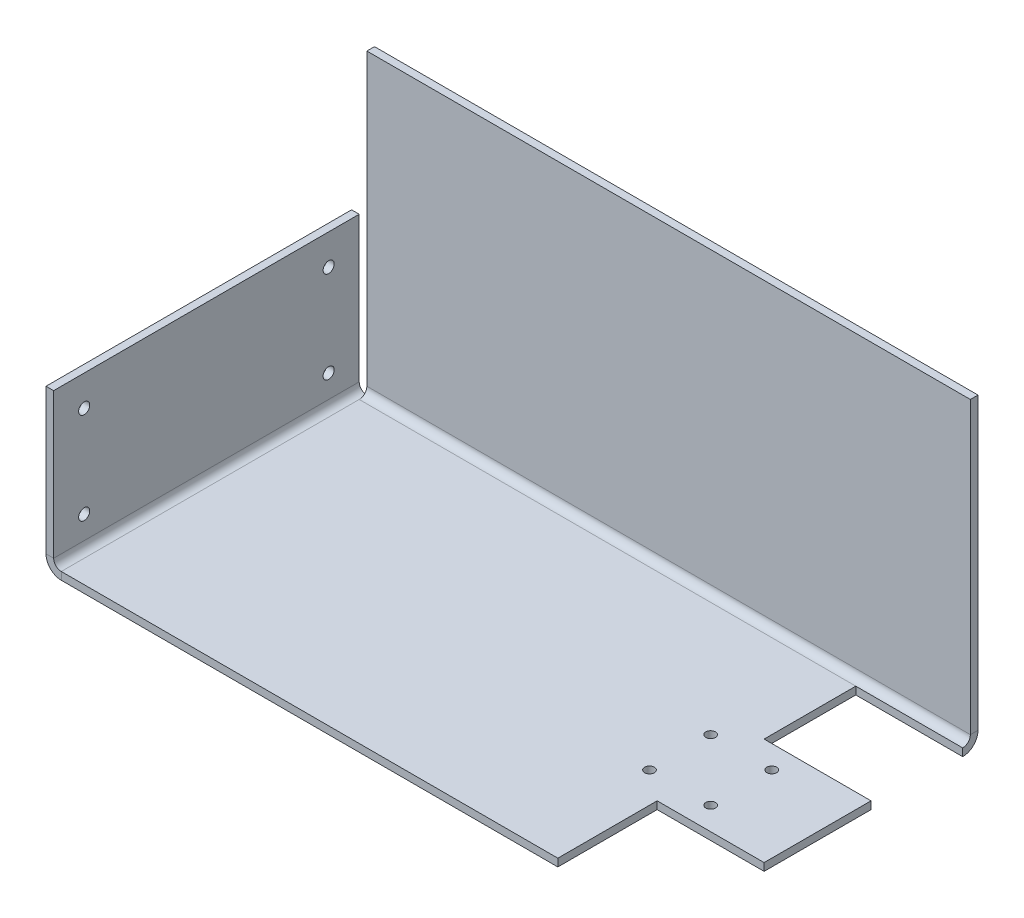
ISO-10303-21;
HEADER;
FILE_DESCRIPTION(('STEP AP214'),'2;1');
FILE_NAME('part.step','',(''),(''),'','','');
FILE_SCHEMA(('AUTOMOTIVE_DESIGN { 1 0 10303 214 1 1 1 1 }'));
ENDSEC;
DATA;
#1=APPLICATION_CONTEXT('core data for automotive mechanical design processes');
#2=APPLICATION_PROTOCOL_DEFINITION('international standard','automotive_design',2000,#1);
#3=PRODUCT_CONTEXT('',#1,'mechanical');
#4=PRODUCT('Part','Part','',(#3));
#5=PRODUCT_RELATED_PRODUCT_CATEGORY('part','',(#4));
#6=PRODUCT_DEFINITION_FORMATION('','',#4);
#7=PRODUCT_DEFINITION_CONTEXT('part definition',#1,'design');
#8=PRODUCT_DEFINITION('design','',#6,#7);
#9=PRODUCT_DEFINITION_SHAPE('','',#8);
#10=(LENGTH_UNIT() NAMED_UNIT(*) SI_UNIT(.MILLI.,.METRE.));
#11=(NAMED_UNIT(*) PLANE_ANGLE_UNIT() SI_UNIT($,.RADIAN.));
#12=(NAMED_UNIT(*) SI_UNIT($,.STERADIAN.) SOLID_ANGLE_UNIT());
#13=UNCERTAINTY_MEASURE_WITH_UNIT(LENGTH_MEASURE(1.E-05),#10,'distance_accuracy_value','');
#14=(GEOMETRIC_REPRESENTATION_CONTEXT(3) GLOBAL_UNCERTAINTY_ASSIGNED_CONTEXT((#13)) GLOBAL_UNIT_ASSIGNED_CONTEXT((#10,
#11,#12)) REPRESENTATION_CONTEXT('',''));
#15=CARTESIAN_POINT('',(0.,0.,0.));
#16=DIRECTION('',(0.,0.,1.));
#17=DIRECTION('',(1.,0.,0.));
#18=AXIS2_PLACEMENT_3D('',#15,#16,#17);
#19=CARTESIAN_POINT('',(0.,-3.175,127.));
#20=DIRECTION('',(0.,1.,0.));
#21=DIRECTION('',(0.,0.,1.));
#22=AXIS2_PLACEMENT_3D('',#19,#20,#21);
#23=PLANE('',#22);
#24=CARTESIAN_POINT('',(222.25,-3.175,50.8));
#25=DIRECTION('',(0.,-1.,0.));
#26=DIRECTION('',(0.,0.,-1.));
#27=AXIS2_PLACEMENT_3D('',#24,#25,#26);
#28=CIRCLE('',#27,2.0193);
#29=CARTESIAN_POINT('',(222.25,-3.175,48.7807));
#30=VERTEX_POINT('',#29);
#31=EDGE_CURVE('E425',#30,#30,#28,.T.);
#32=ORIENTED_EDGE('',*,*,#31,.F.);
#33=EDGE_LOOP('',(#32));
#34=FACE_BOUND('',#33,.T.);
#35=CARTESIAN_POINT('',(196.85,-3.175,50.8));
#36=DIRECTION('',(0.,-1.,0.));
#37=DIRECTION('',(0.,0.,-1.));
#38=AXIS2_PLACEMENT_3D('',#35,#36,#37);
#39=CIRCLE('',#38,2.0193);
#40=CARTESIAN_POINT('',(196.85,-3.175,48.7807));
#41=VERTEX_POINT('',#40);
#42=EDGE_CURVE('E419',#41,#41,#39,.T.);
#43=ORIENTED_EDGE('',*,*,#42,.F.);
#44=EDGE_LOOP('',(#43));
#45=FACE_BOUND('',#44,.T.);
#46=CARTESIAN_POINT('',(196.85,-3.175,76.2));
#47=DIRECTION('',(0.,-1.,0.));
#48=DIRECTION('',(0.,0.,-1.));
#49=AXIS2_PLACEMENT_3D('',#46,#47,#48);
#50=CIRCLE('',#49,2.0193);
#51=CARTESIAN_POINT('',(196.85,-3.175,74.1807));
#52=VERTEX_POINT('',#51);
#53=EDGE_CURVE('E406',#52,#52,#50,.T.);
#54=ORIENTED_EDGE('',*,*,#53,.F.);
#55=EDGE_LOOP('',(#54));
#56=FACE_BOUND('',#55,.T.);
#57=CARTESIAN_POINT('',(222.25,-3.175,76.2));
#58=DIRECTION('',(0.,-1.,0.));
#59=DIRECTION('',(0.,0.,-1.));
#60=AXIS2_PLACEMENT_3D('',#57,#58,#59);
#61=CIRCLE('',#60,2.0193);
#62=CARTESIAN_POINT('',(222.25,-3.175,74.1807));
#63=VERTEX_POINT('',#62);
#64=EDGE_CURVE('E402',#63,#63,#61,.T.);
#65=ORIENTED_EDGE('',*,*,#64,.F.);
#66=EDGE_LOOP('',(#65));
#67=FACE_BOUND('',#66,.T.);
#68=DIRECTION('',(0.,0.,1.));
#69=VECTOR('',#68,1.);
#70=CARTESIAN_POINT('',(209.55,-3.175,0.));
#71=LINE('',#70,#69);
#72=CARTESIAN_POINT('',(209.55,-3.175,85.725));
#73=VERTEX_POINT('',#72);
#74=CARTESIAN_POINT('',(209.55,-3.175,127.));
#75=VERTEX_POINT('',#74);
#76=EDGE_CURVE('E186',#73,#75,#71,.T.);
#77=ORIENTED_EDGE('',*,*,#76,.T.);
#78=DIRECTION('',(1.,0.,0.));
#79=VECTOR('',#78,1.);
#80=CARTESIAN_POINT('',(0.,-3.175,127.));
#81=LINE('',#80,#79);
#82=CARTESIAN_POINT('',(3.175,-3.175,127.));
#83=VERTEX_POINT('',#82);
#84=EDGE_CURVE('E316',#83,#75,#81,.T.);
#85=ORIENTED_EDGE('',*,*,#84,.F.);
#86=DIRECTION('',(0.,0.,-1.));
#87=VECTOR('',#86,1.);
#88=CARTESIAN_POINT('',(3.175,-3.175,127.));
#89=LINE('',#88,#87);
#90=CARTESIAN_POINT('',(3.175,-3.175,3.17499999999998));
#91=VERTEX_POINT('',#90);
#92=EDGE_CURVE('E344',#83,#91,#89,.T.);
#93=ORIENTED_EDGE('',*,*,#92,.T.);
#94=DIRECTION('',(-1.,0.,0.));
#95=VECTOR('',#94,1.);
#96=CARTESIAN_POINT('',(3.17500000000004,-3.17500000000004,3.175));
#97=LINE('',#96,#95);
#98=CARTESIAN_POINT('',(209.55,-3.175,3.17500000000001));
#99=VERTEX_POINT('',#98);
#100=EDGE_CURVE('E279',#91,#99,#97,.F.);
#101=ORIENTED_EDGE('',*,*,#100,.T.);
#102=DIRECTION('',(0.,0.,-1.));
#103=VECTOR('',#102,1.);
#104=CARTESIAN_POINT('',(209.55,-3.175,0.));
#105=LINE('',#104,#103);
#106=CARTESIAN_POINT('',(209.55,-3.175,41.275));
#107=VERTEX_POINT('',#106);
#108=EDGE_CURVE('E210',#107,#99,#105,.T.);
#109=ORIENTED_EDGE('',*,*,#108,.F.);
#110=DIRECTION('',(-1.,0.,0.));
#111=VECTOR('',#110,1.);
#112=CARTESIAN_POINT('',(0.,-3.175,41.275));
#113=LINE('',#112,#111);
#114=CARTESIAN_POINT('',(254.,-3.175,41.275));
#115=VERTEX_POINT('',#114);
#116=EDGE_CURVE('E206',#115,#107,#113,.T.);
#117=ORIENTED_EDGE('',*,*,#116,.F.);
#118=DIRECTION('',(0.,0.,-1.));
#119=VECTOR('',#118,1.);
#120=CARTESIAN_POINT('',(254.,-3.175,127.));
#121=LINE('',#120,#119);
#122=CARTESIAN_POINT('',(254.,-3.175,85.725));
#123=VERTEX_POINT('',#122);
#124=EDGE_CURVE('E198',#123,#115,#121,.T.);
#125=ORIENTED_EDGE('',*,*,#124,.F.);
#126=DIRECTION('',(-1.,0.,0.));
#127=VECTOR('',#126,1.);
#128=CARTESIAN_POINT('',(0.,-3.175,85.725));
#129=LINE('',#128,#127);
#130=EDGE_CURVE('E65',#123,#73,#129,.T.);
#131=ORIENTED_EDGE('',*,*,#130,.T.);
#132=EDGE_LOOP('',(#77,#85,#93,#101,#109,#117,#125,#131));
#133=FACE_BOUND('',#132,.T.);
#134=ADVANCED_FACE('F47',(#34,#45,#56,#67,#133),#23,.F.);
#135=CARTESIAN_POINT('',(0.,0.,127.));
#136=DIRECTION('',(0.,1.,0.));
#137=DIRECTION('',(0.,0.,1.));
#138=AXIS2_PLACEMENT_3D('',#135,#136,#137);
#139=PLANE('',#138);
#140=CARTESIAN_POINT('',(222.25,0.,50.8));
#141=DIRECTION('',(0.,1.,0.));
#142=DIRECTION('',(0.,0.,1.));
#143=AXIS2_PLACEMENT_3D('',#140,#141,#142);
#144=CIRCLE('',#143,2.01929999999999);
#145=CARTESIAN_POINT('',(222.25,0.,52.8193));
#146=VERTEX_POINT('',#145);
#147=EDGE_CURVE('E51',#146,#146,#144,.T.);
#148=ORIENTED_EDGE('',*,*,#147,.F.);
#149=EDGE_LOOP('',(#148));
#150=FACE_BOUND('',#149,.T.);
#151=CARTESIAN_POINT('',(196.85,0.,50.8));
#152=DIRECTION('',(0.,1.,0.));
#153=DIRECTION('',(0.,0.,1.));
#154=AXIS2_PLACEMENT_3D('',#151,#152,#153);
#155=CIRCLE('',#154,2.01929999999999);
#156=CARTESIAN_POINT('',(196.85,0.,52.8193));
#157=VERTEX_POINT('',#156);
#158=EDGE_CURVE('E413',#157,#157,#155,.T.);
#159=ORIENTED_EDGE('',*,*,#158,.F.);
#160=EDGE_LOOP('',(#159));
#161=FACE_BOUND('',#160,.T.);
#162=CARTESIAN_POINT('',(196.85,0.,76.2));
#163=DIRECTION('',(0.,1.,0.));
#164=DIRECTION('',(0.,0.,1.));
#165=AXIS2_PLACEMENT_3D('',#162,#163,#164);
#166=CIRCLE('',#165,2.01929999999999);
#167=CARTESIAN_POINT('',(196.85,0.,78.2193));
#168=VERTEX_POINT('',#167);
#169=EDGE_CURVE('E403',#168,#168,#166,.T.);
#170=ORIENTED_EDGE('',*,*,#169,.F.);
#171=EDGE_LOOP('',(#170));
#172=FACE_BOUND('',#171,.T.);
#173=CARTESIAN_POINT('',(222.25,0.,76.2));
#174=DIRECTION('',(0.,1.,0.));
#175=DIRECTION('',(0.,0.,1.));
#176=AXIS2_PLACEMENT_3D('',#173,#174,#175);
#177=CIRCLE('',#176,2.01929999999999);
#178=CARTESIAN_POINT('',(222.25,0.,78.2193));
#179=VERTEX_POINT('',#178);
#180=EDGE_CURVE('E211',#179,#179,#177,.T.);
#181=ORIENTED_EDGE('',*,*,#180,.F.);
#182=EDGE_LOOP('',(#181));
#183=FACE_BOUND('',#182,.T.);
#184=DIRECTION('',(1.,0.,0.));
#185=VECTOR('',#184,1.);
#186=CARTESIAN_POINT('',(0.,0.,127.));
#187=LINE('',#186,#185);
#188=CARTESIAN_POINT('',(3.175,0.,127.));
#189=VERTEX_POINT('',#188);
#190=CARTESIAN_POINT('',(209.55,0.,127.));
#191=VERTEX_POINT('',#190);
#192=EDGE_CURVE('E319',#189,#191,#187,.T.);
#193=ORIENTED_EDGE('',*,*,#192,.T.);
#194=DIRECTION('',(0.,0.,-1.));
#195=VECTOR('',#194,1.);
#196=CARTESIAN_POINT('',(209.55,0.,127.));
#197=LINE('',#196,#195);
#198=CARTESIAN_POINT('',(209.55,0.,85.725));
#199=VERTEX_POINT('',#198);
#200=EDGE_CURVE('E233',#191,#199,#197,.T.);
#201=ORIENTED_EDGE('',*,*,#200,.T.);
#202=DIRECTION('',(1.,0.,0.));
#203=VECTOR('',#202,1.);
#204=CARTESIAN_POINT('',(0.,0.,85.725));
#205=LINE('',#204,#203);
#206=CARTESIAN_POINT('',(254.,0.,85.725));
#207=VERTEX_POINT('',#206);
#208=EDGE_CURVE('E179',#199,#207,#205,.T.);
#209=ORIENTED_EDGE('',*,*,#208,.T.);
#210=DIRECTION('',(0.,0.,-1.));
#211=VECTOR('',#210,1.);
#212=CARTESIAN_POINT('',(254.,0.,127.));
#213=LINE('',#212,#211);
#214=CARTESIAN_POINT('',(254.,0.,41.275));
#215=VERTEX_POINT('',#214);
#216=EDGE_CURVE('E382',#207,#215,#213,.T.);
#217=ORIENTED_EDGE('',*,*,#216,.T.);
#218=DIRECTION('',(1.,0.,0.));
#219=VECTOR('',#218,1.);
#220=CARTESIAN_POINT('',(0.,0.,41.275));
#221=LINE('',#220,#219);
#222=CARTESIAN_POINT('',(209.55,0.,41.275));
#223=VERTEX_POINT('',#222);
#224=EDGE_CURVE('E228',#223,#215,#221,.T.);
#225=ORIENTED_EDGE('',*,*,#224,.F.);
#226=DIRECTION('',(0.,0.,1.));
#227=VECTOR('',#226,1.);
#228=CARTESIAN_POINT('',(209.55,0.,127.));
#229=LINE('',#228,#227);
#230=CARTESIAN_POINT('',(209.55,0.,3.17500000000001));
#231=VERTEX_POINT('',#230);
#232=EDGE_CURVE('E204',#231,#223,#229,.T.);
#233=ORIENTED_EDGE('',*,*,#232,.F.);
#234=DIRECTION('',(-1.,0.,0.));
#235=VECTOR('',#234,1.);
#236=CARTESIAN_POINT('',(3.17500000000004,0.,3.17499999999999));
#237=LINE('',#236,#235);
#238=CARTESIAN_POINT('',(3.17499999999998,0.,3.17499999999999));
#239=VERTEX_POINT('',#238);
#240=EDGE_CURVE('E296',#239,#231,#237,.F.);
#241=ORIENTED_EDGE('',*,*,#240,.F.);
#242=DIRECTION('',(0.,0.,-1.));
#243=VECTOR('',#242,1.);
#244=CARTESIAN_POINT('',(3.175,0.,127.));
#245=LINE('',#244,#243);
#246=EDGE_CURVE('E379',#189,#239,#245,.T.);
#247=ORIENTED_EDGE('',*,*,#246,.F.);
#248=EDGE_LOOP('',(#193,#201,#209,#217,#225,#233,#241,#247));
#249=FACE_BOUND('',#248,.T.);
#250=ADVANCED_FACE('F501',(#150,#161,#172,#183,#249),#139,.T.);
#251=CARTESIAN_POINT('',(-3.175,3.175,127.));
#252=DIRECTION('',(0.,0.,1.));
#253=DIRECTION('',(1.,0.,0.));
#254=AXIS2_PLACEMENT_3D('',#251,#252,#253);
#255=PLANE('',#254);
#256=ORIENTED_EDGE('',*,*,#84,.T.);
#257=DIRECTION('',(0.,-1.,0.));
#258=VECTOR('',#257,1.);
#259=CARTESIAN_POINT('',(209.55,123.825,127.));
#260=LINE('',#259,#258);
#261=EDGE_CURVE('E183',#191,#75,#260,.T.);
#262=ORIENTED_EDGE('',*,*,#261,.F.);
#263=ORIENTED_EDGE('',*,*,#192,.F.);
#264=DIRECTION('',(0.,-1.,0.));
#265=VECTOR('',#264,1.);
#266=CARTESIAN_POINT('',(3.175,0.,127.));
#267=LINE('',#266,#265);
#268=EDGE_CURVE('E397',#189,#83,#267,.T.);
#269=ORIENTED_EDGE('',*,*,#268,.T.);
#270=EDGE_LOOP('',(#256,#262,#263,#269));
#271=FACE_BOUND('',#270,.T.);
#272=ADVANCED_FACE('F503',(#271),#255,.T.);
#273=CARTESIAN_POINT('',(254.,0.,127.));
#274=DIRECTION('',(1.,0.,0.));
#275=DIRECTION('',(0.,0.,-1.));
#276=AXIS2_PLACEMENT_3D('',#273,#274,#275);
#277=PLANE('',#276);
#278=ORIENTED_EDGE('',*,*,#216,.F.);
#279=DIRECTION('',(0.,-1.,0.));
#280=VECTOR('',#279,1.);
#281=CARTESIAN_POINT('',(254.,0.,85.725));
#282=LINE('',#281,#280);
#283=EDGE_CURVE('E11',#207,#123,#282,.T.);
#284=ORIENTED_EDGE('',*,*,#283,.T.);
#285=ORIENTED_EDGE('',*,*,#124,.T.);
#286=DIRECTION('',(0.,-1.,0.));
#287=VECTOR('',#286,1.);
#288=CARTESIAN_POINT('',(254.,123.825,41.275));
#289=LINE('',#288,#287);
#290=EDGE_CURVE('E193',#215,#115,#289,.T.);
#291=ORIENTED_EDGE('',*,*,#290,.F.);
#292=EDGE_LOOP('',(#278,#284,#285,#291));
#293=FACE_BOUND('',#292,.T.);
#294=ADVANCED_FACE('F567',(#293),#277,.T.);
#295=CARTESIAN_POINT('',(3.175,0.,0.));
#296=DIRECTION('',(1.,0.,0.));
#297=DIRECTION('',(0.,0.,-1.));
#298=AXIS2_PLACEMENT_3D('',#295,#296,#297);
#299=PLANE('',#298);
#300=DIRECTION('',(0.,1.,0.));
#301=VECTOR('',#300,1.);
#302=CARTESIAN_POINT('',(3.175,-3.175,0.));
#303=LINE('',#302,#301);
#304=CARTESIAN_POINT('',(3.175,-3.175,0.));
#305=VERTEX_POINT('',#304);
#306=CARTESIAN_POINT('',(3.175,-2.32426131403124,0.));
#307=VERTEX_POINT('',#306);
#308=EDGE_CURVE('E388',#305,#307,#303,.T.);
#309=ORIENTED_EDGE('',*,*,#308,.T.);
#310=CARTESIAN_POINT('',(3.17499999999998,3.17499999999997,3.17499999999998));
#311=DIRECTION('',(-1.,0.,0.));
#312=DIRECTION('',(0.,0.,1.));
#313=AXIS2_PLACEMENT_3D('',#310,#311,#312);
#314=CIRCLE('',#313,6.35000000000001);
#315=EDGE_CURVE('E57',#307,#91,#314,.T.);
#316=ORIENTED_EDGE('',*,*,#315,.T.);
#317=DIRECTION('',(0.,0.,-1.));
#318=VECTOR('',#317,1.);
#319=CARTESIAN_POINT('',(3.17499999999934,-3.175,127.));
#320=LINE('',#319,#318);
#321=EDGE_CURVE('E311',#91,#305,#320,.T.);
#322=ORIENTED_EDGE('',*,*,#321,.T.);
#323=EDGE_LOOP('',(#309,#316,#322));
#324=FACE_BOUND('',#323,.T.);
#325=ADVANCED_FACE('F576',(#324),#299,.T.);
#326=CARTESIAN_POINT('',(3.175,0.,127.));
#327=DIRECTION('',(0.,0.,1.));
#328=DIRECTION('',(1.,0.,0.));
#329=AXIS2_PLACEMENT_3D('',#326,#327,#328);
#330=PLANE('',#329);
#331=ORIENTED_EDGE('',*,*,#268,.F.);
#332=CARTESIAN_POINT('',(3.175,3.175,127.));
#333=DIRECTION('',(0.,0.,-1.));
#334=DIRECTION('',(-1.,0.,0.));
#335=AXIS2_PLACEMENT_3D('',#332,#333,#334);
#336=CIRCLE('',#335,3.175);
#337=CARTESIAN_POINT('',(0.,3.175,127.));
#338=VERTEX_POINT('',#337);
#339=EDGE_CURVE('E324',#338,#189,#336,.F.);
#340=ORIENTED_EDGE('',*,*,#339,.F.);
#341=DIRECTION('',(1.,0.,0.));
#342=VECTOR('',#341,1.);
#343=CARTESIAN_POINT('',(-3.175,3.175,127.));
#344=LINE('',#343,#342);
#345=CARTESIAN_POINT('',(-3.175,3.175,127.));
#346=VERTEX_POINT('',#345);
#347=EDGE_CURVE('E394',#346,#338,#344,.T.);
#348=ORIENTED_EDGE('',*,*,#347,.F.);
#349=CARTESIAN_POINT('',(3.175,3.175,127.));
#350=DIRECTION('',(0.,0.,1.));
#351=DIRECTION('',(1.,0.,0.));
#352=AXIS2_PLACEMENT_3D('',#349,#350,#351);
#353=CIRCLE('',#352,6.35);
#354=EDGE_CURVE('E340',#346,#83,#353,.T.);
#355=ORIENTED_EDGE('',*,*,#354,.T.);
#356=EDGE_LOOP('',(#331,#340,#348,#355));
#357=FACE_BOUND('',#356,.T.);
#358=ADVANCED_FACE('F49',(#357),#330,.T.);
#359=CARTESIAN_POINT('',(0.,3.175,0.));
#360=DIRECTION('',(0.,0.,-1.));
#361=DIRECTION('',(-1.,0.,0.));
#362=AXIS2_PLACEMENT_3D('',#359,#360,#361);
#363=PLANE('',#362);
#364=DIRECTION('',(-1.,0.,0.));
#365=VECTOR('',#364,1.);
#366=CARTESIAN_POINT('',(0.,3.175,0.));
#367=LINE('',#366,#365);
#368=CARTESIAN_POINT('',(0.,3.175,0.));
#369=VERTEX_POINT('',#368);
#370=CARTESIAN_POINT('',(-3.175,3.175,0.));
#371=VERTEX_POINT('',#370);
#372=EDGE_CURVE('E391',#369,#371,#367,.T.);
#373=ORIENTED_EDGE('',*,*,#372,.F.);
#374=CARTESIAN_POINT('',(3.175,3.175,0.));
#375=DIRECTION('',(0.,0.,-1.));
#376=DIRECTION('',(-1.,0.,0.));
#377=AXIS2_PLACEMENT_3D('',#374,#375,#376);
#378=CIRCLE('',#377,3.175);
#379=CARTESIAN_POINT('',(3.175,0.,0.));
#380=VERTEX_POINT('',#379);
#381=EDGE_CURVE('E315',#369,#380,#378,.F.);
#382=ORIENTED_EDGE('',*,*,#381,.T.);
#383=EDGE_CURVE('E72',#307,#380,#303,.T.);
#384=ORIENTED_EDGE('',*,*,#383,.F.);
#385=ORIENTED_EDGE('',*,*,#308,.F.);
#386=CARTESIAN_POINT('',(3.175,3.175,0.));
#387=DIRECTION('',(0.,0.,1.));
#388=DIRECTION('',(1.,0.,0.));
#389=AXIS2_PLACEMENT_3D('',#386,#387,#388);
#390=CIRCLE('',#389,6.35);
#391=EDGE_CURVE('E320',#371,#305,#390,.T.);
#392=ORIENTED_EDGE('',*,*,#391,.F.);
#393=EDGE_LOOP('',(#373,#382,#384,#385,#392));
#394=FACE_BOUND('',#393,.T.);
#395=ADVANCED_FACE('F570',(#394),#363,.T.);
#396=CARTESIAN_POINT('',(3.175,-3.175,0.));
#397=DIRECTION('',(0.,0.,-1.));
#398=DIRECTION('',(-1.,0.,0.));
#399=AXIS2_PLACEMENT_3D('',#396,#397,#398);
#400=PLANE('',#399);
#401=DIRECTION('',(0.,-1.,0.));
#402=VECTOR('',#401,1.);
#403=CARTESIAN_POINT('',(0.,0.,0.));
#404=LINE('',#403,#402);
#405=CARTESIAN_POINT('',(0.,63.5,0.));
#406=VERTEX_POINT('',#405);
#407=EDGE_CURVE('E347',#406,#369,#404,.T.);
#408=ORIENTED_EDGE('',*,*,#407,.T.);
#409=ORIENTED_EDGE('',*,*,#372,.T.);
#410=DIRECTION('',(0.,1.,0.));
#411=VECTOR('',#410,1.);
#412=CARTESIAN_POINT('',(-3.175,0.,0.));
#413=LINE('',#412,#411);
#414=CARTESIAN_POINT('',(-3.175,63.5,0.));
#415=VERTEX_POINT('',#414);
#416=EDGE_CURVE('E355',#415,#371,#413,.F.);
#417=ORIENTED_EDGE('',*,*,#416,.F.);
#418=DIRECTION('',(1.,0.,0.));
#419=VECTOR('',#418,1.);
#420=CARTESIAN_POINT('',(-3.175,63.5,0.));
#421=LINE('',#420,#419);
#422=EDGE_CURVE('E351',#415,#406,#421,.T.);
#423=ORIENTED_EDGE('',*,*,#422,.T.);
#424=EDGE_LOOP('',(#408,#409,#417,#423));
#425=FACE_BOUND('',#424,.T.);
#426=ADVANCED_FACE('F483',(#425),#400,.T.);
#427=CARTESIAN_POINT('',(3.175,3.175,127.));
#428=DIRECTION('',(0.,0.,-1.));
#429=DIRECTION('',(-1.,0.,0.));
#430=AXIS2_PLACEMENT_3D('',#427,#428,#429);
#431=CYLINDRICAL_SURFACE('',#430,3.175);
#432=ORIENTED_EDGE('',*,*,#381,.F.);
#433=DIRECTION('',(0.,0.,-1.));
#434=VECTOR('',#433,1.);
#435=CARTESIAN_POINT('',(0.,3.175,127.));
#436=LINE('',#435,#434);
#437=EDGE_CURVE('E375',#338,#369,#436,.T.);
#438=ORIENTED_EDGE('',*,*,#437,.F.);
#439=ORIENTED_EDGE('',*,*,#339,.T.);
#440=ORIENTED_EDGE('',*,*,#246,.T.);
#441=DIRECTION('',(0.,0.,1.));
#442=VECTOR('',#441,1.);
#443=CARTESIAN_POINT('',(3.175,0.,0.));
#444=LINE('',#443,#442);
#445=EDGE_CURVE('E307',#380,#239,#444,.T.);
#446=ORIENTED_EDGE('',*,*,#445,.F.);
#447=EDGE_LOOP('',(#432,#438,#439,#440,#446));
#448=FACE_BOUND('',#447,.T.);
#449=ADVANCED_FACE('F468',(#448),#431,.F.);
#450=CARTESIAN_POINT('',(0.,0.,127.));
#451=DIRECTION('',(1.,0.,0.));
#452=DIRECTION('',(0.,0.,-1.));
#453=AXIS2_PLACEMENT_3D('',#450,#451,#452);
#454=PLANE('',#453);
#455=CARTESIAN_POINT('',(0.,50.8,12.7));
#456=DIRECTION('',(1.,0.,0.));
#457=DIRECTION('',(0.,0.,-1.));
#458=AXIS2_PLACEMENT_3D('',#455,#456,#457);
#459=CIRCLE('',#458,2.3114);
#460=CARTESIAN_POINT('',(0.,50.8,10.3886));
#461=VERTEX_POINT('',#460);
#462=EDGE_CURVE('E457',#461,#461,#459,.T.);
#463=ORIENTED_EDGE('',*,*,#462,.F.);
#464=EDGE_LOOP('',(#463));
#465=FACE_BOUND('',#464,.T.);
#466=CARTESIAN_POINT('',(0.,12.7,12.7));
#467=DIRECTION('',(1.,0.,0.));
#468=DIRECTION('',(0.,0.,-1.));
#469=AXIS2_PLACEMENT_3D('',#466,#467,#468);
#470=CIRCLE('',#469,2.3114);
#471=CARTESIAN_POINT('',(0.,12.7,10.3886));
#472=VERTEX_POINT('',#471);
#473=EDGE_CURVE('E449',#472,#472,#470,.T.);
#474=ORIENTED_EDGE('',*,*,#473,.F.);
#475=EDGE_LOOP('',(#474));
#476=FACE_BOUND('',#475,.T.);
#477=CARTESIAN_POINT('',(0.,12.7,114.3));
#478=DIRECTION('',(1.,0.,0.));
#479=DIRECTION('',(0.,0.,-1.));
#480=AXIS2_PLACEMENT_3D('',#477,#478,#479);
#481=CIRCLE('',#480,2.3114);
#482=CARTESIAN_POINT('',(0.,12.7,111.9886));
#483=VERTEX_POINT('',#482);
#484=EDGE_CURVE('E441',#483,#483,#481,.T.);
#485=ORIENTED_EDGE('',*,*,#484,.F.);
#486=EDGE_LOOP('',(#485));
#487=FACE_BOUND('',#486,.T.);
#488=CARTESIAN_POINT('',(0.,50.8,114.3));
#489=DIRECTION('',(1.,0.,0.));
#490=DIRECTION('',(0.,0.,-1.));
#491=AXIS2_PLACEMENT_3D('',#488,#489,#490);
#492=CIRCLE('',#491,2.3114);
#493=CARTESIAN_POINT('',(0.,50.8,111.9886));
#494=VERTEX_POINT('',#493);
#495=EDGE_CURVE('E433',#494,#494,#492,.T.);
#496=ORIENTED_EDGE('',*,*,#495,.F.);
#497=EDGE_LOOP('',(#496));
#498=FACE_BOUND('',#497,.T.);
#499=ORIENTED_EDGE('',*,*,#407,.F.);
#500=DIRECTION('',(0.,0.,-1.));
#501=VECTOR('',#500,1.);
#502=CARTESIAN_POINT('',(0.,63.5,127.));
#503=LINE('',#502,#501);
#504=CARTESIAN_POINT('',(0.,63.5,127.));
#505=VERTEX_POINT('',#504);
#506=EDGE_CURVE('E372',#505,#406,#503,.T.);
#507=ORIENTED_EDGE('',*,*,#506,.F.);
#508=DIRECTION('',(0.,-1.,0.));
#509=VECTOR('',#508,1.);
#510=CARTESIAN_POINT('',(0.,0.,127.));
#511=LINE('',#510,#509);
#512=EDGE_CURVE('E328',#505,#338,#511,.T.);
#513=ORIENTED_EDGE('',*,*,#512,.T.);
#514=ORIENTED_EDGE('',*,*,#437,.T.);
#515=EDGE_LOOP('',(#499,#507,#513,#514));
#516=FACE_BOUND('',#515,.T.);
#517=ADVANCED_FACE('F464',(#465,#476,#487,#498,#516),#454,.T.);
#518=CARTESIAN_POINT('',(-3.175,63.5,127.));
#519=DIRECTION('',(0.,1.,0.));
#520=DIRECTION('',(0.,0.,1.));
#521=AXIS2_PLACEMENT_3D('',#518,#519,#520);
#522=PLANE('',#521);
#523=ORIENTED_EDGE('',*,*,#422,.F.);
#524=DIRECTION('',(0.,0.,-1.));
#525=VECTOR('',#524,1.);
#526=CARTESIAN_POINT('',(-3.175,63.5,127.));
#527=LINE('',#526,#525);
#528=CARTESIAN_POINT('',(-3.175,63.5,127.));
#529=VERTEX_POINT('',#528);
#530=EDGE_CURVE('E369',#529,#415,#527,.T.);
#531=ORIENTED_EDGE('',*,*,#530,.F.);
#532=DIRECTION('',(1.,0.,0.));
#533=VECTOR('',#532,1.);
#534=CARTESIAN_POINT('',(-3.175,63.5,127.));
#535=LINE('',#534,#533);
#536=EDGE_CURVE('E332',#529,#505,#535,.T.);
#537=ORIENTED_EDGE('',*,*,#536,.T.);
#538=ORIENTED_EDGE('',*,*,#506,.T.);
#539=EDGE_LOOP('',(#523,#531,#537,#538));
#540=FACE_BOUND('',#539,.T.);
#541=ADVANCED_FACE('F467',(#540),#522,.T.);
#542=CARTESIAN_POINT('',(-3.175,0.,127.));
#543=DIRECTION('',(1.,0.,0.));
#544=DIRECTION('',(0.,0.,-1.));
#545=AXIS2_PLACEMENT_3D('',#542,#543,#544);
#546=PLANE('',#545);
#547=CARTESIAN_POINT('',(-3.175,50.8,12.7));
#548=DIRECTION('',(1.,0.,0.));
#549=DIRECTION('',(0.,0.,-1.));
#550=AXIS2_PLACEMENT_3D('',#547,#548,#549);
#551=CIRCLE('',#550,2.3114);
#552=CARTESIAN_POINT('',(-3.175,50.8,10.3886));
#553=VERTEX_POINT('',#552);
#554=EDGE_CURVE('E453',#553,#553,#551,.T.);
#555=ORIENTED_EDGE('',*,*,#554,.T.);
#556=EDGE_LOOP('',(#555));
#557=FACE_BOUND('',#556,.T.);
#558=CARTESIAN_POINT('',(-3.175,12.7,12.7));
#559=DIRECTION('',(1.,0.,0.));
#560=DIRECTION('',(0.,0.,-1.));
#561=AXIS2_PLACEMENT_3D('',#558,#559,#560);
#562=CIRCLE('',#561,2.3114);
#563=CARTESIAN_POINT('',(-3.175,12.7,10.3886));
#564=VERTEX_POINT('',#563);
#565=EDGE_CURVE('E445',#564,#564,#562,.T.);
#566=ORIENTED_EDGE('',*,*,#565,.T.);
#567=EDGE_LOOP('',(#566));
#568=FACE_BOUND('',#567,.T.);
#569=CARTESIAN_POINT('',(-3.175,12.7,114.3));
#570=DIRECTION('',(1.,0.,0.));
#571=DIRECTION('',(0.,0.,-1.));
#572=AXIS2_PLACEMENT_3D('',#569,#570,#571);
#573=CIRCLE('',#572,2.3114);
#574=CARTESIAN_POINT('',(-3.175,12.7,111.9886));
#575=VERTEX_POINT('',#574);
#576=EDGE_CURVE('E437',#575,#575,#573,.T.);
#577=ORIENTED_EDGE('',*,*,#576,.T.);
#578=EDGE_LOOP('',(#577));
#579=FACE_BOUND('',#578,.T.);
#580=CARTESIAN_POINT('',(-3.175,50.8,114.3));
#581=DIRECTION('',(1.,0.,0.));
#582=DIRECTION('',(0.,0.,-1.));
#583=AXIS2_PLACEMENT_3D('',#580,#581,#582);
#584=CIRCLE('',#583,2.3114);
#585=CARTESIAN_POINT('',(-3.175,50.8,111.9886));
#586=VERTEX_POINT('',#585);
#587=EDGE_CURVE('E429',#586,#586,#584,.T.);
#588=ORIENTED_EDGE('',*,*,#587,.T.);
#589=EDGE_LOOP('',(#588));
#590=FACE_BOUND('',#589,.T.);
#591=ORIENTED_EDGE('',*,*,#416,.T.);
#592=DIRECTION('',(0.,0.,-1.));
#593=VECTOR('',#592,1.);
#594=CARTESIAN_POINT('',(-3.175,3.175,127.));
#595=LINE('',#594,#593);
#596=EDGE_CURVE('E365',#346,#371,#595,.T.);
#597=ORIENTED_EDGE('',*,*,#596,.F.);
#598=DIRECTION('',(0.,1.,0.));
#599=VECTOR('',#598,1.);
#600=CARTESIAN_POINT('',(-3.175,0.,127.));
#601=LINE('',#600,#599);
#602=EDGE_CURVE('E336',#529,#346,#601,.F.);
#603=ORIENTED_EDGE('',*,*,#602,.F.);
#604=ORIENTED_EDGE('',*,*,#530,.T.);
#605=EDGE_LOOP('',(#591,#597,#603,#604));
#606=FACE_BOUND('',#605,.T.);
#607=ADVANCED_FACE('F636',(#557,#568,#579,#590,#606),#546,.F.);
#608=CARTESIAN_POINT('',(3.175,3.175,127.));
#609=DIRECTION('',(0.,0.,-1.));
#610=DIRECTION('',(-1.,0.,0.));
#611=AXIS2_PLACEMENT_3D('',#608,#609,#610);
#612=CYLINDRICAL_SURFACE('',#611,6.35);
#613=ORIENTED_EDGE('',*,*,#391,.T.);
#614=ORIENTED_EDGE('',*,*,#321,.F.);
#615=ORIENTED_EDGE('',*,*,#92,.F.);
#616=ORIENTED_EDGE('',*,*,#354,.F.);
#617=ORIENTED_EDGE('',*,*,#596,.T.);
#618=EDGE_LOOP('',(#613,#614,#615,#616,#617));
#619=FACE_BOUND('',#618,.T.);
#620=ADVANCED_FACE('F639',(#619),#612,.T.);
#621=CARTESIAN_POINT('',(3.175,3.175,127.));
#622=DIRECTION('',(0.,0.,-1.));
#623=DIRECTION('',(-1.,0.,0.));
#624=AXIS2_PLACEMENT_3D('',#621,#622,#623);
#625=PLANE('',#624);
#626=ORIENTED_EDGE('',*,*,#602,.T.);
#627=ORIENTED_EDGE('',*,*,#347,.T.);
#628=ORIENTED_EDGE('',*,*,#512,.F.);
#629=ORIENTED_EDGE('',*,*,#536,.F.);
#630=EDGE_LOOP('',(#626,#627,#628,#629));
#631=FACE_BOUND('',#630,.T.);
#632=ADVANCED_FACE('F488',(#631),#625,.F.);
#633=CARTESIAN_POINT('',(254.,3.17499999999997,3.175));
#634=DIRECTION('',(1.,0.,0.));
#635=DIRECTION('',(0.,0.,-1.));
#636=AXIS2_PLACEMENT_3D('',#633,#634,#635);
#637=PLANE('',#636);
#638=DIRECTION('',(0.,0.,-1.));
#639=VECTOR('',#638,1.);
#640=CARTESIAN_POINT('',(254.,3.17499999999999,0.));
#641=LINE('',#640,#639);
#642=CARTESIAN_POINT('',(254.,3.17499999999996,0.));
#643=VERTEX_POINT('',#642);
#644=CARTESIAN_POINT('',(254.,3.17499999999994,-3.17500000000001));
#645=VERTEX_POINT('',#644);
#646=EDGE_CURVE('E236',#643,#645,#641,.T.);
#647=ORIENTED_EDGE('',*,*,#646,.F.);
#648=CARTESIAN_POINT('',(254.,3.17499999999997,3.175));
#649=DIRECTION('',(-1.,0.,0.));
#650=DIRECTION('',(0.,0.,1.));
#651=AXIS2_PLACEMENT_3D('',#648,#649,#650);
#652=CIRCLE('',#651,3.17500000000001);
#653=CARTESIAN_POINT('',(254.,0.,3.17500000000001));
#654=VERTEX_POINT('',#653);
#655=EDGE_CURVE('E292',#654,#643,#652,.F.);
#656=ORIENTED_EDGE('',*,*,#655,.F.);
#657=DIRECTION('',(0.,-1.,0.));
#658=VECTOR('',#657,1.);
#659=CARTESIAN_POINT('',(254.,0.,3.17500000000001));
#660=LINE('',#659,#658);
#661=CARTESIAN_POINT('',(254.,-3.175,3.17500000000001));
#662=VERTEX_POINT('',#661);
#663=EDGE_CURVE('E288',#654,#662,#660,.T.);
#664=ORIENTED_EDGE('',*,*,#663,.T.);
#665=CARTESIAN_POINT('',(254.,3.17499999999997,3.175));
#666=DIRECTION('',(-1.,0.,0.));
#667=DIRECTION('',(0.,0.,1.));
#668=AXIS2_PLACEMENT_3D('',#665,#666,#667);
#669=CIRCLE('',#668,6.35000000000001);
#670=EDGE_CURVE('E283',#662,#645,#669,.F.);
#671=ORIENTED_EDGE('',*,*,#670,.T.);
#672=EDGE_LOOP('',(#647,#656,#664,#671));
#673=FACE_BOUND('',#672,.T.);
#674=ADVANCED_FACE('F519',(#673),#637,.T.);
#675=CARTESIAN_POINT('',(3.17499999999998,3.17499999999997,3.17499999999998));
#676=DIRECTION('',(1.,0.,0.));
#677=DIRECTION('',(0.,0.,-1.));
#678=AXIS2_PLACEMENT_3D('',#675,#676,#677);
#679=PLANE('',#678);
#680=CARTESIAN_POINT('',(3.17499999999998,3.17500000000001,-3.17500000000001));
#681=VERTEX_POINT('',#680);
#682=EDGE_CURVE('E284',#681,#307,#314,.T.);
#683=ORIENTED_EDGE('',*,*,#682,.T.);
#684=ORIENTED_EDGE('',*,*,#383,.T.);
#685=ORIENTED_EDGE('',*,*,#445,.T.);
#686=CARTESIAN_POINT('',(3.17499999999998,3.17499999999997,3.17499999999998));
#687=DIRECTION('',(-1.,0.,0.));
#688=DIRECTION('',(0.,0.,1.));
#689=AXIS2_PLACEMENT_3D('',#686,#687,#688);
#690=CIRCLE('',#689,3.17500000000001);
#691=CARTESIAN_POINT('',(3.17499999999998,3.17499999999996,0.));
#692=VERTEX_POINT('',#691);
#693=EDGE_CURVE('E278',#692,#239,#690,.T.);
#694=ORIENTED_EDGE('',*,*,#693,.F.);
#695=DIRECTION('',(0.,0.,-1.));
#696=VECTOR('',#695,1.);
#697=CARTESIAN_POINT('',(3.17499999999998,3.17499999999999,0.));
#698=LINE('',#697,#696);
#699=EDGE_CURVE('E240',#692,#681,#698,.T.);
#700=ORIENTED_EDGE('',*,*,#699,.T.);
#701=EDGE_LOOP('',(#683,#684,#685,#694,#700));
#702=FACE_BOUND('',#701,.T.);
#703=ADVANCED_FACE('F543',(#702),#679,.F.);
#704=CARTESIAN_POINT('',(3.17500000000004,3.17499999999997,3.17499999999998));
#705=DIRECTION('',(-1.,0.,0.));
#706=DIRECTION('',(0.,0.,-1.));
#707=AXIS2_PLACEMENT_3D('',#704,#705,#706);
#708=CYLINDRICAL_SURFACE('',#707,6.35000000000001);
#709=ORIENTED_EDGE('',*,*,#100,.F.);
#710=ORIENTED_EDGE('',*,*,#315,.F.);
#711=ORIENTED_EDGE('',*,*,#682,.F.);
#712=DIRECTION('',(1.,0.,0.));
#713=VECTOR('',#712,1.);
#714=CARTESIAN_POINT('',(0.,3.17500000000001,-3.17500000000001));
#715=LINE('',#714,#713);
#716=EDGE_CURVE('E244',#681,#645,#715,.T.);
#717=ORIENTED_EDGE('',*,*,#716,.T.);
#718=ORIENTED_EDGE('',*,*,#670,.F.);
#719=DIRECTION('',(1.,0.,0.));
#720=VECTOR('',#719,1.);
#721=CARTESIAN_POINT('',(0.,-3.175,3.175));
#722=LINE('',#721,#720);
#723=EDGE_CURVE('E215',#99,#662,#722,.T.);
#724=ORIENTED_EDGE('',*,*,#723,.F.);
#725=EDGE_LOOP('',(#709,#710,#711,#717,#718,#724));
#726=FACE_BOUND('',#725,.T.);
#727=ADVANCED_FACE('F511',(#726),#708,.T.);
#728=CARTESIAN_POINT('',(3.17500000000004,3.17499999999997,3.17499999999998));
#729=DIRECTION('',(-1.,0.,0.));
#730=DIRECTION('',(0.,0.,-1.));
#731=AXIS2_PLACEMENT_3D('',#728,#729,#730);
#732=CYLINDRICAL_SURFACE('',#731,3.17500000000001);
#733=ORIENTED_EDGE('',*,*,#240,.T.);
#734=EDGE_CURVE('E300',#231,#654,#237,.F.);
#735=ORIENTED_EDGE('',*,*,#734,.T.);
#736=ORIENTED_EDGE('',*,*,#655,.T.);
#737=DIRECTION('',(-1.,0.,0.));
#738=VECTOR('',#737,1.);
#739=CARTESIAN_POINT('',(254.,3.17499999999999,0.));
#740=LINE('',#739,#738);
#741=EDGE_CURVE('E237',#643,#692,#740,.T.);
#742=ORIENTED_EDGE('',*,*,#741,.T.);
#743=ORIENTED_EDGE('',*,*,#693,.T.);
#744=EDGE_LOOP('',(#733,#735,#736,#742,#743));
#745=FACE_BOUND('',#744,.T.);
#746=ADVANCED_FACE('F522',(#745),#732,.F.);
#747=CARTESIAN_POINT('',(3.175,123.825,-3.17500000000043));
#748=DIRECTION('',(1.,0.,0.));
#749=DIRECTION('',(0.,0.,-1.));
#750=AXIS2_PLACEMENT_3D('',#747,#748,#749);
#751=PLANE('',#750);
#752=ORIENTED_EDGE('',*,*,#699,.F.);
#753=DIRECTION('',(0.,1.,0.));
#754=VECTOR('',#753,1.);
#755=CARTESIAN_POINT('',(3.175,123.825,-4.32332676782251E-13));
#756=LINE('',#755,#754);
#757=CARTESIAN_POINT('',(3.175,123.825,-4.32332676782251E-13));
#758=VERTEX_POINT('',#757);
#759=EDGE_CURVE('E250',#692,#758,#756,.T.);
#760=ORIENTED_EDGE('',*,*,#759,.T.);
#761=DIRECTION('',(0.,0.,1.));
#762=VECTOR('',#761,1.);
#763=CARTESIAN_POINT('',(3.175,123.825,-3.17500000000043));
#764=LINE('',#763,#762);
#765=CARTESIAN_POINT('',(3.175,123.825,-3.17500000000043));
#766=VERTEX_POINT('',#765);
#767=EDGE_CURVE('E274',#766,#758,#764,.T.);
#768=ORIENTED_EDGE('',*,*,#767,.F.);
#769=DIRECTION('',(0.,1.,0.));
#770=VECTOR('',#769,1.);
#771=CARTESIAN_POINT('',(3.175,123.825,-3.17500000000043));
#772=LINE('',#771,#770);
#773=EDGE_CURVE('E251',#681,#766,#772,.T.);
#774=ORIENTED_EDGE('',*,*,#773,.F.);
#775=EDGE_LOOP('',(#752,#760,#768,#774));
#776=FACE_BOUND('',#775,.T.);
#777=ADVANCED_FACE('F540',(#776),#751,.F.);
#778=CARTESIAN_POINT('',(254.,0.,-3.175));
#779=DIRECTION('',(-1.,0.,0.));
#780=DIRECTION('',(0.,0.,1.));
#781=AXIS2_PLACEMENT_3D('',#778,#779,#780);
#782=PLANE('',#781);
#783=ORIENTED_EDGE('',*,*,#646,.T.);
#784=DIRECTION('',(0.,-1.,0.));
#785=VECTOR('',#784,1.);
#786=CARTESIAN_POINT('',(254.,0.,-3.175));
#787=LINE('',#786,#785);
#788=CARTESIAN_POINT('',(254.,123.825,-3.17500000000043));
#789=VERTEX_POINT('',#788);
#790=EDGE_CURVE('E258',#789,#645,#787,.T.);
#791=ORIENTED_EDGE('',*,*,#790,.F.);
#792=DIRECTION('',(0.,0.,1.));
#793=VECTOR('',#792,1.);
#794=CARTESIAN_POINT('',(254.,123.825,-3.17500000000043));
#795=LINE('',#794,#793);
#796=CARTESIAN_POINT('',(254.,123.825,-4.32332676782251E-13));
#797=VERTEX_POINT('',#796);
#798=EDGE_CURVE('E262',#789,#797,#795,.T.);
#799=ORIENTED_EDGE('',*,*,#798,.T.);
#800=DIRECTION('',(0.,-1.,0.));
#801=VECTOR('',#800,1.);
#802=CARTESIAN_POINT('',(254.,0.,0.));
#803=LINE('',#802,#801);
#804=EDGE_CURVE('E255',#797,#643,#803,.T.);
#805=ORIENTED_EDGE('',*,*,#804,.T.);
#806=EDGE_LOOP('',(#783,#791,#799,#805));
#807=FACE_BOUND('',#806,.T.);
#808=ADVANCED_FACE('F530',(#807),#782,.F.);
#809=CARTESIAN_POINT('',(0.,0.,-3.175));
#810=DIRECTION('',(0.,0.,1.));
#811=DIRECTION('',(0.,-1.,0.));
#812=AXIS2_PLACEMENT_3D('',#809,#810,#811);
#813=PLANE('',#812);
#814=ORIENTED_EDGE('',*,*,#716,.F.);
#815=ORIENTED_EDGE('',*,*,#773,.T.);
#816=DIRECTION('',(1.,0.,0.));
#817=VECTOR('',#816,1.);
#818=CARTESIAN_POINT('',(254.,123.825,-3.17500000000043));
#819=LINE('',#818,#817);
#820=EDGE_CURVE('E254',#766,#789,#819,.T.);
#821=ORIENTED_EDGE('',*,*,#820,.T.);
#822=ORIENTED_EDGE('',*,*,#790,.T.);
#823=EDGE_LOOP('',(#814,#815,#821,#822));
#824=FACE_BOUND('',#823,.T.);
#825=ADVANCED_FACE('F545',(#824),#813,.F.);
#826=CARTESIAN_POINT('',(0.,0.,0.));
#827=DIRECTION('',(0.,0.,1.));
#828=DIRECTION('',(0.,-1.,0.));
#829=AXIS2_PLACEMENT_3D('',#826,#827,#828);
#830=PLANE('',#829);
#831=ORIENTED_EDGE('',*,*,#759,.F.);
#832=ORIENTED_EDGE('',*,*,#741,.F.);
#833=ORIENTED_EDGE('',*,*,#804,.F.);
#834=DIRECTION('',(1.,0.,0.));
#835=VECTOR('',#834,1.);
#836=CARTESIAN_POINT('',(254.,123.825,-4.32332676782251E-13));
#837=LINE('',#836,#835);
#838=EDGE_CURVE('E265',#758,#797,#837,.T.);
#839=ORIENTED_EDGE('',*,*,#838,.F.);
#840=EDGE_LOOP('',(#831,#832,#833,#839));
#841=FACE_BOUND('',#840,.T.);
#842=ADVANCED_FACE('F527',(#841),#830,.T.);
#843=CARTESIAN_POINT('',(254.,123.825,-3.17500000000043));
#844=DIRECTION('',(0.,-1.,0.));
#845=DIRECTION('',(0.,0.,-1.));
#846=AXIS2_PLACEMENT_3D('',#843,#844,#845);
#847=PLANE('',#846);
#848=ORIENTED_EDGE('',*,*,#838,.T.);
#849=ORIENTED_EDGE('',*,*,#798,.F.);
#850=ORIENTED_EDGE('',*,*,#820,.F.);
#851=ORIENTED_EDGE('',*,*,#767,.T.);
#852=EDGE_LOOP('',(#848,#849,#850,#851));
#853=FACE_BOUND('',#852,.T.);
#854=ADVANCED_FACE('F535',(#853),#847,.F.);
#855=CARTESIAN_POINT('',(0.,123.825,3.175));
#856=DIRECTION('',(0.,0.,-1.));
#857=DIRECTION('',(-1.,0.,0.));
#858=AXIS2_PLACEMENT_3D('',#855,#856,#857);
#859=PLANE('',#858);
#860=DIRECTION('',(0.,-1.,0.));
#861=VECTOR('',#860,1.);
#862=CARTESIAN_POINT('',(209.55,123.825,3.17500000000001));
#863=LINE('',#862,#861);
#864=EDGE_CURVE('E221',#231,#99,#863,.T.);
#865=ORIENTED_EDGE('',*,*,#864,.T.);
#866=ORIENTED_EDGE('',*,*,#723,.T.);
#867=ORIENTED_EDGE('',*,*,#663,.F.);
#868=ORIENTED_EDGE('',*,*,#734,.F.);
#869=EDGE_LOOP('',(#865,#866,#867,#868));
#870=FACE_BOUND('',#869,.T.);
#871=ADVANCED_FACE('F514',(#870),#859,.F.);
#872=CARTESIAN_POINT('',(0.,123.825,41.275));
#873=DIRECTION('',(0.,0.,1.));
#874=DIRECTION('',(1.,0.,0.));
#875=AXIS2_PLACEMENT_3D('',#872,#873,#874);
#876=PLANE('',#875);
#877=ORIENTED_EDGE('',*,*,#224,.T.);
#878=ORIENTED_EDGE('',*,*,#290,.T.);
#879=ORIENTED_EDGE('',*,*,#116,.T.);
#880=DIRECTION('',(0.,-1.,0.));
#881=VECTOR('',#880,1.);
#882=CARTESIAN_POINT('',(209.55,123.825,41.275));
#883=LINE('',#882,#881);
#884=EDGE_CURVE('E218',#223,#107,#883,.T.);
#885=ORIENTED_EDGE('',*,*,#884,.F.);
#886=EDGE_LOOP('',(#877,#878,#879,#885));
#887=FACE_BOUND('',#886,.T.);
#888=ADVANCED_FACE('F588',(#887),#876,.F.);
#889=CARTESIAN_POINT('',(209.55,123.825,0.));
#890=DIRECTION('',(-1.,0.,0.));
#891=DIRECTION('',(0.,0.,1.));
#892=AXIS2_PLACEMENT_3D('',#889,#890,#891);
#893=PLANE('',#892);
#894=ORIENTED_EDGE('',*,*,#232,.T.);
#895=ORIENTED_EDGE('',*,*,#884,.T.);
#896=ORIENTED_EDGE('',*,*,#108,.T.);
#897=ORIENTED_EDGE('',*,*,#864,.F.);
#898=EDGE_LOOP('',(#894,#895,#896,#897));
#899=FACE_BOUND('',#898,.T.);
#900=ADVANCED_FACE('F590',(#899),#893,.F.);
#901=CARTESIAN_POINT('',(209.55,123.825,0.));
#902=DIRECTION('',(1.,0.,0.));
#903=DIRECTION('',(0.,0.,-1.));
#904=AXIS2_PLACEMENT_3D('',#901,#902,#903);
#905=PLANE('',#904);
#906=ORIENTED_EDGE('',*,*,#261,.T.);
#907=ORIENTED_EDGE('',*,*,#76,.F.);
#908=DIRECTION('',(0.,-1.,0.));
#909=VECTOR('',#908,1.);
#910=CARTESIAN_POINT('',(209.55,123.825,85.725));
#911=LINE('',#910,#909);
#912=EDGE_CURVE('E175',#199,#73,#911,.T.);
#913=ORIENTED_EDGE('',*,*,#912,.F.);
#914=ORIENTED_EDGE('',*,*,#200,.F.);
#915=EDGE_LOOP('',(#906,#907,#913,#914));
#916=FACE_BOUND('',#915,.T.);
#917=ADVANCED_FACE('F187',(#916),#905,.T.);
#918=CARTESIAN_POINT('',(0.,123.825,85.725));
#919=DIRECTION('',(0.,0.,1.));
#920=DIRECTION('',(1.,0.,0.));
#921=AXIS2_PLACEMENT_3D('',#918,#919,#920);
#922=PLANE('',#921);
#923=ORIENTED_EDGE('',*,*,#912,.T.);
#924=ORIENTED_EDGE('',*,*,#130,.F.);
#925=ORIENTED_EDGE('',*,*,#283,.F.);
#926=ORIENTED_EDGE('',*,*,#208,.F.);
#927=EDGE_LOOP('',(#923,#924,#925,#926));
#928=FACE_BOUND('',#927,.T.);
#929=ADVANCED_FACE('F177',(#928),#922,.T.);
#930=CARTESIAN_POINT('',(222.25,-3.175,76.2));
#931=DIRECTION('',(0.,-1.,0.));
#932=DIRECTION('',(0.,0.,-1.));
#933=AXIS2_PLACEMENT_3D('',#930,#931,#932);
#934=CYLINDRICAL_SURFACE('',#933,2.01929999999999);
#935=ORIENTED_EDGE('',*,*,#180,.T.);
#936=EDGE_LOOP('',(#935));
#937=FACE_BOUND('',#936,.T.);
#938=ORIENTED_EDGE('',*,*,#64,.T.);
#939=EDGE_LOOP('',(#938));
#940=FACE_BOUND('',#939,.T.);
#941=ADVANCED_FACE('F603',(#937,#940),#934,.F.);
#942=CARTESIAN_POINT('',(196.85,-3.175,76.2));
#943=DIRECTION('',(0.,-1.,0.));
#944=DIRECTION('',(0.,0.,-1.));
#945=AXIS2_PLACEMENT_3D('',#942,#943,#944);
#946=CYLINDRICAL_SURFACE('',#945,2.01929999999999);
#947=ORIENTED_EDGE('',*,*,#169,.T.);
#948=EDGE_LOOP('',(#947));
#949=FACE_BOUND('',#948,.T.);
#950=ORIENTED_EDGE('',*,*,#53,.T.);
#951=EDGE_LOOP('',(#950));
#952=FACE_BOUND('',#951,.T.);
#953=ADVANCED_FACE('F606',(#949,#952),#946,.F.);
#954=CARTESIAN_POINT('',(196.85,-3.175,50.8));
#955=DIRECTION('',(0.,-1.,0.));
#956=DIRECTION('',(0.,0.,-1.));
#957=AXIS2_PLACEMENT_3D('',#954,#955,#956);
#958=CYLINDRICAL_SURFACE('',#957,2.01929999999999);
#959=ORIENTED_EDGE('',*,*,#158,.T.);
#960=EDGE_LOOP('',(#959));
#961=FACE_BOUND('',#960,.T.);
#962=ORIENTED_EDGE('',*,*,#42,.T.);
#963=EDGE_LOOP('',(#962));
#964=FACE_BOUND('',#963,.T.);
#965=ADVANCED_FACE('F610',(#961,#964),#958,.F.);
#966=CARTESIAN_POINT('',(222.25,-3.175,50.8));
#967=DIRECTION('',(0.,-1.,0.));
#968=DIRECTION('',(0.,0.,-1.));
#969=AXIS2_PLACEMENT_3D('',#966,#967,#968);
#970=CYLINDRICAL_SURFACE('',#969,2.01929999999999);
#971=ORIENTED_EDGE('',*,*,#147,.T.);
#972=EDGE_LOOP('',(#971));
#973=FACE_BOUND('',#972,.T.);
#974=ORIENTED_EDGE('',*,*,#31,.T.);
#975=EDGE_LOOP('',(#974));
#976=FACE_BOUND('',#975,.T.);
#977=ADVANCED_FACE('F613',(#973,#976),#970,.F.);
#978=CARTESIAN_POINT('',(0.,50.8,114.3));
#979=DIRECTION('',(1.,0.,0.));
#980=DIRECTION('',(0.,0.,-1.));
#981=AXIS2_PLACEMENT_3D('',#978,#979,#980);
#982=CYLINDRICAL_SURFACE('',#981,2.3114);
#983=ORIENTED_EDGE('',*,*,#587,.F.);
#984=EDGE_LOOP('',(#983));
#985=FACE_BOUND('',#984,.T.);
#986=ORIENTED_EDGE('',*,*,#495,.T.);
#987=EDGE_LOOP('',(#986));
#988=FACE_BOUND('',#987,.T.);
#989=ADVANCED_FACE('F617',(#985,#988),#982,.F.);
#990=CARTESIAN_POINT('',(0.,12.7,114.3));
#991=DIRECTION('',(1.,0.,0.));
#992=DIRECTION('',(0.,0.,-1.));
#993=AXIS2_PLACEMENT_3D('',#990,#991,#992);
#994=CYLINDRICAL_SURFACE('',#993,2.3114);
#995=ORIENTED_EDGE('',*,*,#576,.F.);
#996=EDGE_LOOP('',(#995));
#997=FACE_BOUND('',#996,.T.);
#998=ORIENTED_EDGE('',*,*,#484,.T.);
#999=EDGE_LOOP('',(#998));
#1000=FACE_BOUND('',#999,.T.);
#1001=ADVANCED_FACE('F621',(#997,#1000),#994,.F.);
#1002=CARTESIAN_POINT('',(0.,12.7,12.7));
#1003=DIRECTION('',(1.,0.,0.));
#1004=DIRECTION('',(0.,0.,-1.));
#1005=AXIS2_PLACEMENT_3D('',#1002,#1003,#1004);
#1006=CYLINDRICAL_SURFACE('',#1005,2.3114);
#1007=ORIENTED_EDGE('',*,*,#565,.F.);
#1008=EDGE_LOOP('',(#1007));
#1009=FACE_BOUND('',#1008,.T.);
#1010=ORIENTED_EDGE('',*,*,#473,.T.);
#1011=EDGE_LOOP('',(#1010));
#1012=FACE_BOUND('',#1011,.T.);
#1013=ADVANCED_FACE('F625',(#1009,#1012),#1006,.F.);
#1014=CARTESIAN_POINT('',(0.,50.8,12.7));
#1015=DIRECTION('',(1.,0.,0.));
#1016=DIRECTION('',(0.,0.,-1.));
#1017=AXIS2_PLACEMENT_3D('',#1014,#1015,#1016);
#1018=CYLINDRICAL_SURFACE('',#1017,2.3114);
#1019=ORIENTED_EDGE('',*,*,#554,.F.);
#1020=EDGE_LOOP('',(#1019));
#1021=FACE_BOUND('',#1020,.T.);
#1022=ORIENTED_EDGE('',*,*,#462,.T.);
#1023=EDGE_LOOP('',(#1022));
#1024=FACE_BOUND('',#1023,.T.);
#1025=ADVANCED_FACE('F462',(#1021,#1024),#1018,.F.);
#1026=CLOSED_SHELL('',(#134,#250,#272,#294,#325,#358,#395,#426,#449,#517,#541,#607,#620,#632,
#674,#703,#727,#746,#777,#808,#825,#842,#854,#871,#888,#900,#917,#929,#941,#953,#965,#977,#989,
#1001,#1013,#1025));
#1027=MANIFOLD_SOLID_BREP('B2',#1026);
#1028=ADVANCED_BREP_SHAPE_REPRESENTATION('',(#18,#1027),#14);
#1029=SHAPE_DEFINITION_REPRESENTATION(#9,#1028);
ENDSEC;
END-ISO-10303-21;
